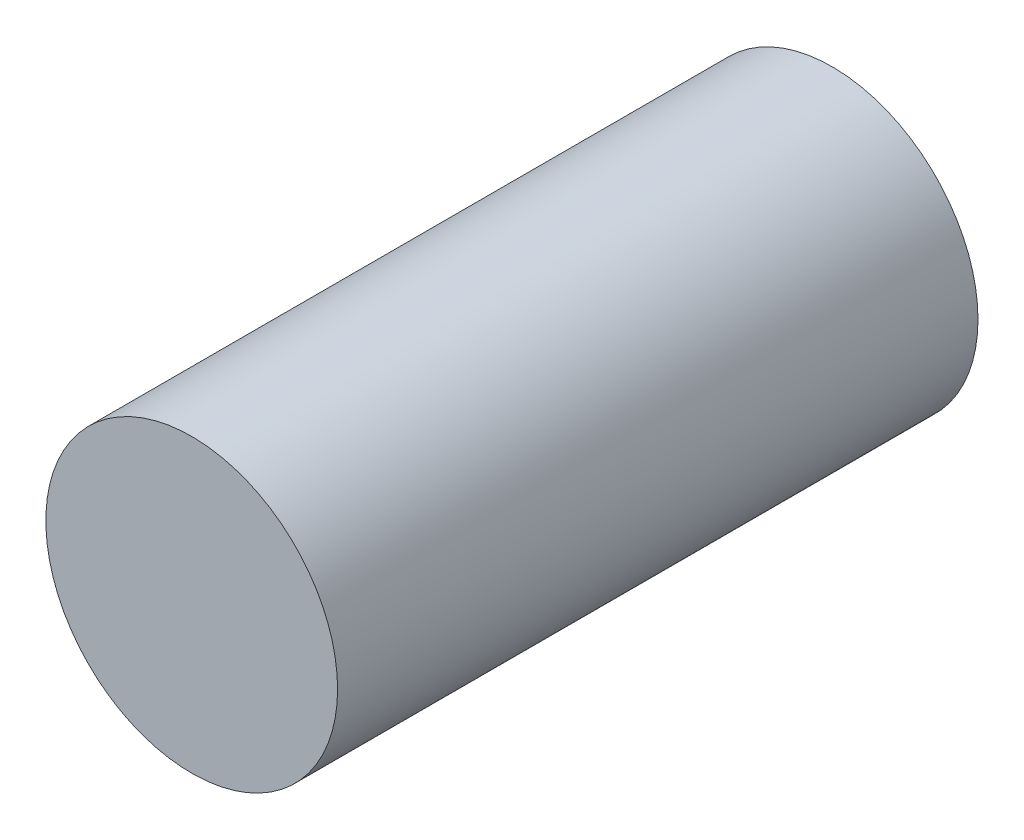
ISO-10303-21;
HEADER;
FILE_DESCRIPTION(('STEP AP214'),'2;1');
FILE_NAME('part.step','',(''),(''),'','','');
FILE_SCHEMA(('AUTOMOTIVE_DESIGN { 1 0 10303 214 1 1 1 1 }'));
ENDSEC;
DATA;
#1=APPLICATION_CONTEXT('core data for automotive mechanical design processes');
#2=APPLICATION_PROTOCOL_DEFINITION('international standard','automotive_design',2000,#1);
#3=PRODUCT_CONTEXT('',#1,'mechanical');
#4=PRODUCT('Part','Part','',(#3));
#5=PRODUCT_RELATED_PRODUCT_CATEGORY('part','',(#4));
#6=PRODUCT_DEFINITION_FORMATION('','',#4);
#7=PRODUCT_DEFINITION_CONTEXT('part definition',#1,'design');
#8=PRODUCT_DEFINITION('design','',#6,#7);
#9=PRODUCT_DEFINITION_SHAPE('','',#8);
#10=(LENGTH_UNIT() NAMED_UNIT(*) SI_UNIT(.MILLI.,.METRE.));
#11=(NAMED_UNIT(*) PLANE_ANGLE_UNIT() SI_UNIT($,.RADIAN.));
#12=(NAMED_UNIT(*) SI_UNIT($,.STERADIAN.) SOLID_ANGLE_UNIT());
#13=UNCERTAINTY_MEASURE_WITH_UNIT(LENGTH_MEASURE(1.E-05),#10,'distance_accuracy_value','');
#14=(GEOMETRIC_REPRESENTATION_CONTEXT(3) GLOBAL_UNCERTAINTY_ASSIGNED_CONTEXT((#13)) GLOBAL_UNIT_ASSIGNED_CONTEXT((#10,
#11,#12)) REPRESENTATION_CONTEXT('',''));
#15=CARTESIAN_POINT('',(0.,0.,0.));
#16=DIRECTION('',(0.,0.,1.));
#17=DIRECTION('',(1.,0.,0.));
#18=AXIS2_PLACEMENT_3D('',#15,#16,#17);
#19=CARTESIAN_POINT('',(-7.62,1.27,0.1));
#20=DIRECTION('',(0.,0.,1.));
#21=DIRECTION('',(1.,0.,0.));
#22=AXIS2_PLACEMENT_3D('',#19,#20,#21);
#23=PLANE('',#22);
#24=CARTESIAN_POINT('',(-7.62,1.27,0.1));
#25=DIRECTION('',(0.,0.,1.));
#26=DIRECTION('',(1.,0.,0.));
#27=AXIS2_PLACEMENT_3D('',#24,#25,#26);
#28=CIRCLE('',#27,0.41);
#29=CARTESIAN_POINT('',(-7.21,1.27,0.1));
#30=VERTEX_POINT('',#29);
#31=EDGE_CURVE('E17',#30,#30,#28,.F.);
#32=ORIENTED_EDGE('',*,*,#31,.F.);
#33=EDGE_LOOP('',(#32));
#34=FACE_BOUND('',#33,.T.);
#35=ADVANCED_FACE('F14',(#34),#23,.T.);
#36=CARTESIAN_POINT('',(-7.62,1.27,-1.7));
#37=DIRECTION('',(0.,0.,1.));
#38=DIRECTION('',(1.,0.,0.));
#39=AXIS2_PLACEMENT_3D('',#36,#37,#38);
#40=PLANE('',#39);
#41=CARTESIAN_POINT('',(-7.62,1.27,-1.7));
#42=DIRECTION('',(0.,0.,1.));
#43=DIRECTION('',(1.,0.,0.));
#44=AXIS2_PLACEMENT_3D('',#41,#42,#43);
#45=CIRCLE('',#44,0.41);
#46=CARTESIAN_POINT('',(-7.21,1.27,-1.7));
#47=VERTEX_POINT('',#46);
#48=EDGE_CURVE('E10',#47,#47,#45,.T.);
#49=ORIENTED_EDGE('',*,*,#48,.F.);
#50=EDGE_LOOP('',(#49));
#51=FACE_BOUND('',#50,.T.);
#52=ADVANCED_FACE('F29',(#51),#40,.F.);
#53=CARTESIAN_POINT('',(-7.62,1.27,-1.7));
#54=DIRECTION('',(0.,0.,1.));
#55=DIRECTION('',(1.,0.,0.));
#56=AXIS2_PLACEMENT_3D('',#53,#54,#55);
#57=CYLINDRICAL_SURFACE('',#56,0.41);
#58=ORIENTED_EDGE('',*,*,#48,.T.);
#59=EDGE_LOOP('',(#58));
#60=FACE_BOUND('',#59,.T.);
#61=ORIENTED_EDGE('',*,*,#31,.T.);
#62=EDGE_LOOP('',(#61));
#63=FACE_BOUND('',#62,.T.);
#64=ADVANCED_FACE('F26',(#60,#63),#57,.T.);
#65=CLOSED_SHELL('',(#35,#52,#64));
#66=MANIFOLD_SOLID_BREP('B1',#65);
#67=ADVANCED_BREP_SHAPE_REPRESENTATION('',(#18,#66),#14);
#68=SHAPE_DEFINITION_REPRESENTATION(#9,#67);
ENDSEC;
END-ISO-10303-21;
